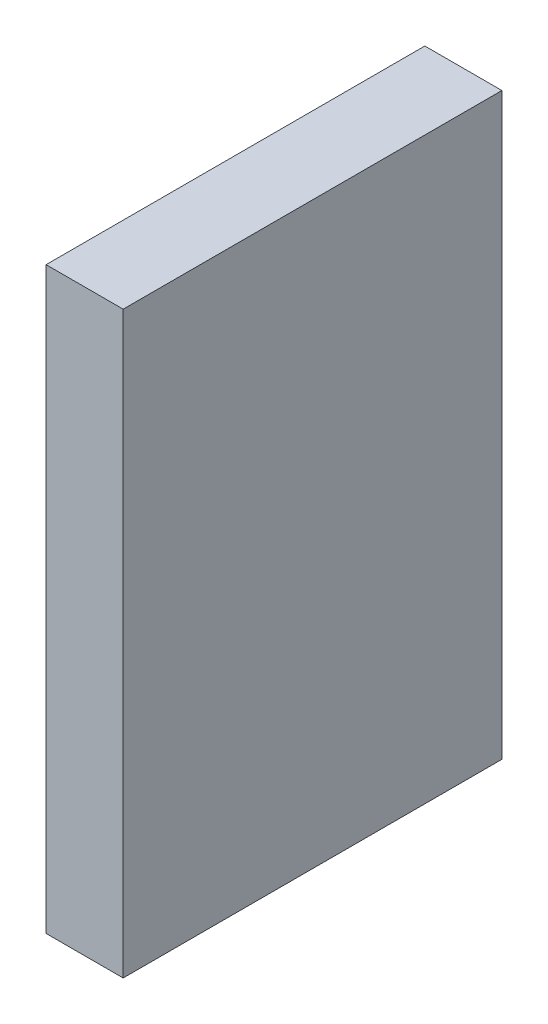
ISO-10303-21;
HEADER;
FILE_DESCRIPTION(('STEP AP214'),'2;1');
FILE_NAME('part.step','',(''),(''),'','','');
FILE_SCHEMA(('AUTOMOTIVE_DESIGN { 1 0 10303 214 1 1 1 1 }'));
ENDSEC;
DATA;
#1=APPLICATION_CONTEXT('core data for automotive mechanical design processes');
#2=APPLICATION_PROTOCOL_DEFINITION('international standard','automotive_design',2000,#1);
#3=PRODUCT_CONTEXT('',#1,'mechanical');
#4=PRODUCT('Part','Part','',(#3));
#5=PRODUCT_RELATED_PRODUCT_CATEGORY('part','',(#4));
#6=PRODUCT_DEFINITION_FORMATION('','',#4);
#7=PRODUCT_DEFINITION_CONTEXT('part definition',#1,'design');
#8=PRODUCT_DEFINITION('design','',#6,#7);
#9=PRODUCT_DEFINITION_SHAPE('','',#8);
#10=(LENGTH_UNIT() NAMED_UNIT(*) SI_UNIT(.MILLI.,.METRE.));
#11=(NAMED_UNIT(*) PLANE_ANGLE_UNIT() SI_UNIT($,.RADIAN.));
#12=(NAMED_UNIT(*) SI_UNIT($,.STERADIAN.) SOLID_ANGLE_UNIT());
#13=UNCERTAINTY_MEASURE_WITH_UNIT(LENGTH_MEASURE(1.E-05),#10,'distance_accuracy_value','');
#14=(GEOMETRIC_REPRESENTATION_CONTEXT(3) GLOBAL_UNCERTAINTY_ASSIGNED_CONTEXT((#13)) GLOBAL_UNIT_ASSIGNED_CONTEXT((#10,
#11,#12)) REPRESENTATION_CONTEXT('',''));
#15=CARTESIAN_POINT('',(0.,0.,0.));
#16=DIRECTION('',(0.,0.,1.));
#17=DIRECTION('',(1.,0.,0.));
#18=AXIS2_PLACEMENT_3D('',#15,#16,#17);
#19=CARTESIAN_POINT('',(43.942,211.455,101.144456521739));
#20=DIRECTION('',(0.,0.,-1.));
#21=DIRECTION('',(0.,1.,0.));
#22=AXIS2_PLACEMENT_3D('',#19,#20,#21);
#23=PLANE('',#22);
#24=DIRECTION('',(0.,-1.,0.));
#25=VECTOR('',#24,1.);
#26=CARTESIAN_POINT('',(0.,211.455,101.144456521739));
#27=LINE('',#26,#25);
#28=CARTESIAN_POINT('',(0.,211.455,101.144456521739));
#29=VERTEX_POINT('',#28);
#30=CARTESIAN_POINT('',(0.,-118.745,101.144456521739));
#31=VERTEX_POINT('',#30);
#32=EDGE_CURVE('E103',#29,#31,#27,.T.);
#33=ORIENTED_EDGE('',*,*,#32,.T.);
#34=DIRECTION('',(-1.,0.,0.));
#35=VECTOR('',#34,1.);
#36=CARTESIAN_POINT('',(43.942,-118.745,101.144456521739));
#37=LINE('',#36,#35);
#38=CARTESIAN_POINT('',(43.942,-118.745,101.144456521739));
#39=VERTEX_POINT('',#38);
#40=EDGE_CURVE('E11',#39,#31,#37,.T.);
#41=ORIENTED_EDGE('',*,*,#40,.F.);
#42=DIRECTION('',(0.,-1.,0.));
#43=VECTOR('',#42,1.);
#44=CARTESIAN_POINT('',(43.942,211.455,101.144456521739));
#45=LINE('',#44,#43);
#46=CARTESIAN_POINT('',(43.942,211.455,101.144456521739));
#47=VERTEX_POINT('',#46);
#48=EDGE_CURVE('E91',#47,#39,#45,.T.);
#49=ORIENTED_EDGE('',*,*,#48,.F.);
#50=DIRECTION('',(-1.,0.,0.));
#51=VECTOR('',#50,1.);
#52=CARTESIAN_POINT('',(43.942,211.455,101.144456521739));
#53=LINE('',#52,#51);
#54=EDGE_CURVE('E99',#47,#29,#53,.T.);
#55=ORIENTED_EDGE('',*,*,#54,.T.);
#56=EDGE_LOOP('',(#33,#41,#49,#55));
#57=FACE_BOUND('',#56,.T.);
#58=ADVANCED_FACE('F40',(#57),#23,.F.);
#59=CARTESIAN_POINT('',(43.942,-118.745,101.144456521739));
#60=DIRECTION('',(0.,1.,0.));
#61=DIRECTION('',(0.,0.,1.));
#62=AXIS2_PLACEMENT_3D('',#59,#60,#61);
#63=PLANE('',#62);
#64=DIRECTION('',(0.,0.,-1.));
#65=VECTOR('',#64,1.);
#66=CARTESIAN_POINT('',(0.,-118.745,101.144456521739));
#67=LINE('',#66,#65);
#68=CARTESIAN_POINT('',(0.,-118.745,-114.755543478261));
#69=VERTEX_POINT('',#68);
#70=EDGE_CURVE('E95',#31,#69,#67,.T.);
#71=ORIENTED_EDGE('',*,*,#70,.T.);
#72=DIRECTION('',(-1.,0.,0.));
#73=VECTOR('',#72,1.);
#74=CARTESIAN_POINT('',(43.942,-118.745,-114.755543478261));
#75=LINE('',#74,#73);
#76=CARTESIAN_POINT('',(43.942,-118.745,-114.755543478261));
#77=VERTEX_POINT('',#76);
#78=EDGE_CURVE('E48',#77,#69,#75,.T.);
#79=ORIENTED_EDGE('',*,*,#78,.F.);
#80=DIRECTION('',(0.,0.,-1.));
#81=VECTOR('',#80,1.);
#82=CARTESIAN_POINT('',(43.942,-118.745,101.144456521739));
#83=LINE('',#82,#81);
#84=EDGE_CURVE('E86',#39,#77,#83,.T.);
#85=ORIENTED_EDGE('',*,*,#84,.F.);
#86=ORIENTED_EDGE('',*,*,#40,.T.);
#87=EDGE_LOOP('',(#71,#79,#85,#86));
#88=FACE_BOUND('',#87,.T.);
#89=ADVANCED_FACE('F94',(#88),#63,.F.);
#90=CARTESIAN_POINT('',(43.942,211.455,-114.755543478261));
#91=DIRECTION('',(0.,0.,1.));
#92=DIRECTION('',(0.,-1.,0.));
#93=AXIS2_PLACEMENT_3D('',#90,#91,#92);
#94=PLANE('',#93);
#95=DIRECTION('',(0.,1.,0.));
#96=VECTOR('',#95,1.);
#97=CARTESIAN_POINT('',(0.,211.455,-114.755543478261));
#98=LINE('',#97,#96);
#99=CARTESIAN_POINT('',(0.,211.455,-114.755543478261));
#100=VERTEX_POINT('',#99);
#101=EDGE_CURVE('E73',#69,#100,#98,.T.);
#102=ORIENTED_EDGE('',*,*,#101,.T.);
#103=DIRECTION('',(-1.,0.,0.));
#104=VECTOR('',#103,1.);
#105=CARTESIAN_POINT('',(43.942,211.455,-114.755543478261));
#106=LINE('',#105,#104);
#107=CARTESIAN_POINT('',(43.942,211.455,-114.755543478261));
#108=VERTEX_POINT('',#107);
#109=EDGE_CURVE('E96',#108,#100,#106,.T.);
#110=ORIENTED_EDGE('',*,*,#109,.F.);
#111=DIRECTION('',(0.,1.,0.));
#112=VECTOR('',#111,1.);
#113=CARTESIAN_POINT('',(43.942,211.455,-114.755543478261));
#114=LINE('',#113,#112);
#115=EDGE_CURVE('E89',#77,#108,#114,.T.);
#116=ORIENTED_EDGE('',*,*,#115,.F.);
#117=ORIENTED_EDGE('',*,*,#78,.T.);
#118=EDGE_LOOP('',(#102,#110,#116,#117));
#119=FACE_BOUND('',#118,.T.);
#120=ADVANCED_FACE('F97',(#119),#94,.F.);
#121=CARTESIAN_POINT('',(43.942,211.455,101.144456521739));
#122=DIRECTION('',(0.,-1.,0.));
#123=DIRECTION('',(0.,0.,-1.));
#124=AXIS2_PLACEMENT_3D('',#121,#122,#123);
#125=PLANE('',#124);
#126=DIRECTION('',(0.,0.,1.));
#127=VECTOR('',#126,1.);
#128=CARTESIAN_POINT('',(0.,211.455,101.144456521739));
#129=LINE('',#128,#127);
#130=EDGE_CURVE('E79',#100,#29,#129,.T.);
#131=ORIENTED_EDGE('',*,*,#130,.T.);
#132=ORIENTED_EDGE('',*,*,#54,.F.);
#133=DIRECTION('',(0.,0.,1.));
#134=VECTOR('',#133,1.);
#135=CARTESIAN_POINT('',(43.942,211.455,101.144456521739));
#136=LINE('',#135,#134);
#137=EDGE_CURVE('E56',#108,#47,#136,.T.);
#138=ORIENTED_EDGE('',*,*,#137,.F.);
#139=ORIENTED_EDGE('',*,*,#109,.T.);
#140=EDGE_LOOP('',(#131,#132,#138,#139));
#141=FACE_BOUND('',#140,.T.);
#142=ADVANCED_FACE('F110',(#141),#125,.F.);
#143=CARTESIAN_POINT('',(43.942,0.,0.));
#144=DIRECTION('',(1.,0.,0.));
#145=DIRECTION('',(0.,0.,-1.));
#146=AXIS2_PLACEMENT_3D('',#143,#144,#145);
#147=PLANE('',#146);
#148=ORIENTED_EDGE('',*,*,#48,.T.);
#149=ORIENTED_EDGE('',*,*,#84,.T.);
#150=ORIENTED_EDGE('',*,*,#115,.T.);
#151=ORIENTED_EDGE('',*,*,#137,.T.);
#152=EDGE_LOOP('',(#148,#149,#150,#151));
#153=FACE_BOUND('',#152,.T.);
#154=ADVANCED_FACE('F87',(#153),#147,.T.);
#155=CARTESIAN_POINT('',(0.,0.,0.));
#156=DIRECTION('',(1.,0.,0.));
#157=DIRECTION('',(0.,0.,-1.));
#158=AXIS2_PLACEMENT_3D('',#155,#156,#157);
#159=PLANE('',#158);
#160=ORIENTED_EDGE('',*,*,#32,.F.);
#161=ORIENTED_EDGE('',*,*,#130,.F.);
#162=ORIENTED_EDGE('',*,*,#101,.F.);
#163=ORIENTED_EDGE('',*,*,#70,.F.);
#164=EDGE_LOOP('',(#160,#161,#162,#163));
#165=FACE_BOUND('',#164,.T.);
#166=ADVANCED_FACE('F113',(#165),#159,.F.);
#167=CLOSED_SHELL('',(#58,#89,#120,#142,#154,#166));
#168=MANIFOLD_SOLID_BREP('B2',#167);
#169=ADVANCED_BREP_SHAPE_REPRESENTATION('',(#18,#168),#14);
#170=SHAPE_DEFINITION_REPRESENTATION(#9,#169);
ENDSEC;
END-ISO-10303-21;
